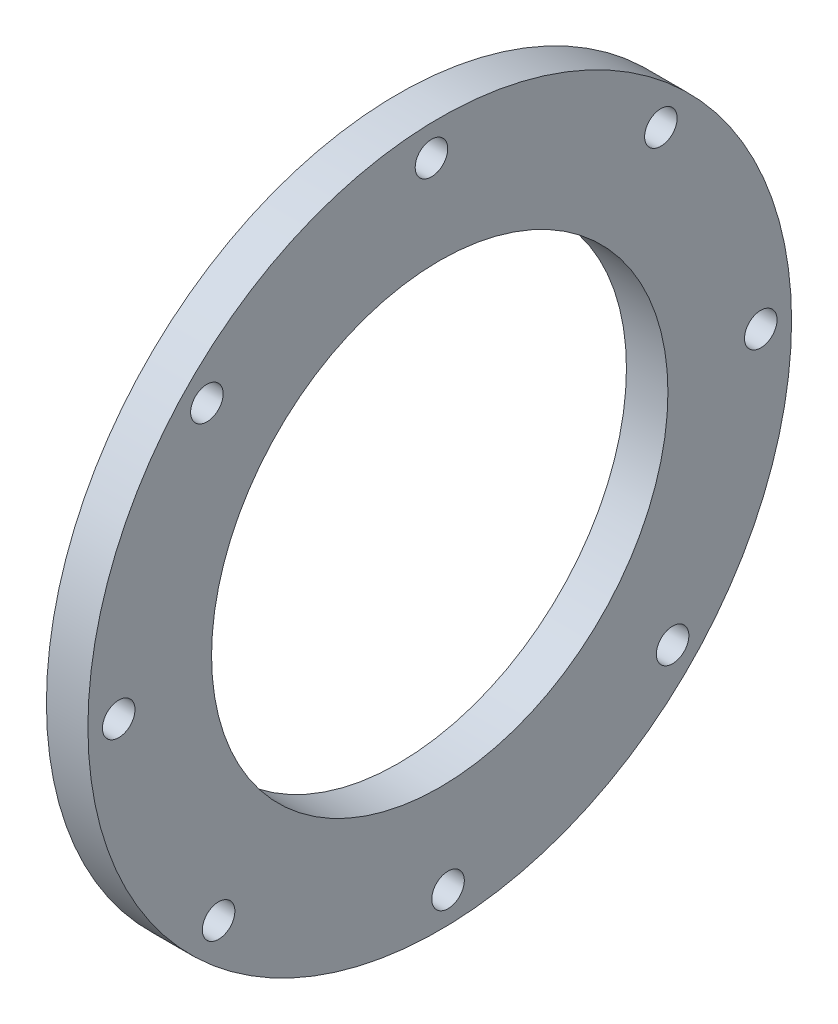
ISO-10303-21;
HEADER;
FILE_DESCRIPTION(('STEP AP214'),'2;1');
FILE_NAME('part.step','',(''),(''),'','','');
FILE_SCHEMA(('AUTOMOTIVE_DESIGN { 1 0 10303 214 1 1 1 1 }'));
ENDSEC;
DATA;
#1=APPLICATION_CONTEXT('core data for automotive mechanical design processes');
#2=APPLICATION_PROTOCOL_DEFINITION('international standard','automotive_design',2000,#1);
#3=PRODUCT_CONTEXT('',#1,'mechanical');
#4=PRODUCT('Part','Part','',(#3));
#5=PRODUCT_RELATED_PRODUCT_CATEGORY('part','',(#4));
#6=PRODUCT_DEFINITION_FORMATION('','',#4);
#7=PRODUCT_DEFINITION_CONTEXT('part definition',#1,'design');
#8=PRODUCT_DEFINITION('design','',#6,#7);
#9=PRODUCT_DEFINITION_SHAPE('','',#8);
#10=(LENGTH_UNIT() NAMED_UNIT(*) SI_UNIT(.MILLI.,.METRE.));
#11=(NAMED_UNIT(*) PLANE_ANGLE_UNIT() SI_UNIT($,.RADIAN.));
#12=(NAMED_UNIT(*) SI_UNIT($,.STERADIAN.) SOLID_ANGLE_UNIT());
#13=UNCERTAINTY_MEASURE_WITH_UNIT(LENGTH_MEASURE(1.E-05),#10,'distance_accuracy_value','');
#14=(GEOMETRIC_REPRESENTATION_CONTEXT(3) GLOBAL_UNCERTAINTY_ASSIGNED_CONTEXT((#13)) GLOBAL_UNIT_ASSIGNED_CONTEXT((#10,
#11,#12)) REPRESENTATION_CONTEXT('',''));
#15=CARTESIAN_POINT('',(0.,0.,0.));
#16=DIRECTION('',(0.,0.,1.));
#17=DIRECTION('',(1.,0.,0.));
#18=AXIS2_PLACEMENT_3D('',#15,#16,#17);
#19=CARTESIAN_POINT('',(-95.25,0.,0.));
#20=DIRECTION('',(-1.,0.,0.));
#21=DIRECTION('',(0.,0.,1.));
#22=AXIS2_PLACEMENT_3D('',#19,#20,#21);
#23=PLANE('',#22);
#24=CARTESIAN_POINT('',(-95.25,-33.8451131491048,-35.6389185711925));
#25=DIRECTION('',(-1.,0.,0.));
#26=DIRECTION('',(0.,0.,1.));
#27=AXIS2_PLACEMENT_3D('',#24,#25,#26);
#28=CIRCLE('',#27,2.4892);
#29=CARTESIAN_POINT('',(-95.25,-33.8451131491048,-33.1497185711925));
#30=VERTEX_POINT('',#29);
#31=EDGE_CURVE('E84',#30,#30,#28,.T.);
#32=ORIENTED_EDGE('',*,*,#31,.F.);
#33=EDGE_LOOP('',(#32));
#34=FACE_BOUND('',#33,.T.);
#35=CARTESIAN_POINT('',(-95.25,-35.6389185711926,33.8451131491078));
#36=DIRECTION('',(-1.,0.,0.));
#37=DIRECTION('',(0.,0.,1.));
#38=AXIS2_PLACEMENT_3D('',#35,#36,#37);
#39=CIRCLE('',#38,2.4892);
#40=CARTESIAN_POINT('',(-95.25,-35.6389185711926,36.3343131491078));
#41=VERTEX_POINT('',#40);
#42=EDGE_CURVE('E72',#41,#41,#39,.T.);
#43=ORIENTED_EDGE('',*,*,#42,.F.);
#44=EDGE_LOOP('',(#43));
#45=FACE_BOUND('',#44,.T.);
#46=CARTESIAN_POINT('',(-95.25,33.8451131491077,35.6389185711955));
#47=DIRECTION('',(-1.,0.,0.));
#48=DIRECTION('',(0.,0.,1.));
#49=AXIS2_PLACEMENT_3D('',#46,#47,#48);
#50=CIRCLE('',#49,2.4892);
#51=CARTESIAN_POINT('',(-95.25,33.8451131491077,38.1281185711955));
#52=VERTEX_POINT('',#51);
#53=EDGE_CURVE('E60',#52,#52,#50,.T.);
#54=ORIENTED_EDGE('',*,*,#53,.F.);
#55=EDGE_LOOP('',(#54));
#56=FACE_BOUND('',#55,.T.);
#57=CARTESIAN_POINT('',(-95.25,35.6389185711954,-33.8451131491047));
#58=DIRECTION('',(-1.,0.,0.));
#59=DIRECTION('',(0.,0.,1.));
#60=AXIS2_PLACEMENT_3D('',#57,#58,#59);
#61=CIRCLE('',#60,2.4892);
#62=CARTESIAN_POINT('',(-95.25,35.6389185711954,-31.3559131491047));
#63=VERTEX_POINT('',#62);
#64=EDGE_CURVE('E48',#63,#63,#61,.T.);
#65=ORIENTED_EDGE('',*,*,#64,.F.);
#66=EDGE_LOOP('',(#65));
#67=FACE_BOUND('',#66,.T.);
#68=CARTESIAN_POINT('',(-95.25,0.,0.));
#69=DIRECTION('',(-1.,0.,0.));
#70=DIRECTION('',(0.,0.,1.));
#71=AXIS2_PLACEMENT_3D('',#68,#69,#70);
#72=CIRCLE('',#71,53.848);
#73=CARTESIAN_POINT('',(-95.25,0.,53.848));
#74=VERTEX_POINT('',#73);
#75=EDGE_CURVE('E10',#74,#74,#72,.T.);
#76=ORIENTED_EDGE('',*,*,#75,.T.);
#77=EDGE_LOOP('',(#76));
#78=FACE_BOUND('',#77,.T.);
#79=CARTESIAN_POINT('',(-95.25,0.,0.));
#80=DIRECTION('',(-1.,0.,0.));
#81=DIRECTION('',(0.,0.,1.));
#82=AXIS2_PLACEMENT_3D('',#79,#80,#81);
#83=CIRCLE('',#82,34.925);
#84=CARTESIAN_POINT('',(-95.25,0.,34.925));
#85=VERTEX_POINT('',#84);
#86=EDGE_CURVE('E43',#85,#85,#83,.T.);
#87=ORIENTED_EDGE('',*,*,#86,.F.);
#88=EDGE_LOOP('',(#87));
#89=FACE_BOUND('',#88,.T.);
#90=CARTESIAN_POINT('',(-95.25,49.1326300136069,1.26841197808897));
#91=DIRECTION('',(-1.,0.,0.));
#92=DIRECTION('',(0.,0.,1.));
#93=AXIS2_PLACEMENT_3D('',#90,#91,#92);
#94=CIRCLE('',#93,2.4892);
#95=CARTESIAN_POINT('',(-95.25,49.1326300136069,3.75761197808897));
#96=VERTEX_POINT('',#95);
#97=EDGE_CURVE('E54',#96,#96,#94,.T.);
#98=ORIENTED_EDGE('',*,*,#97,.F.);
#99=EDGE_LOOP('',(#98));
#100=FACE_BOUND('',#99,.T.);
#101=CARTESIAN_POINT('',(-95.25,-1.26841197808603,49.132630013607));
#102=DIRECTION('',(-1.,0.,0.));
#103=DIRECTION('',(0.,0.,1.));
#104=AXIS2_PLACEMENT_3D('',#101,#102,#103);
#105=CIRCLE('',#104,2.4892);
#106=CARTESIAN_POINT('',(-95.25,-1.26841197808603,51.621830013607));
#107=VERTEX_POINT('',#106);
#108=EDGE_CURVE('E66',#107,#107,#105,.T.);
#109=ORIENTED_EDGE('',*,*,#108,.F.);
#110=EDGE_LOOP('',(#109));
#111=FACE_BOUND('',#110,.T.);
#112=CARTESIAN_POINT('',(-95.25,-49.132630013604,-1.26841197808594));
#113=DIRECTION('',(-1.,0.,0.));
#114=DIRECTION('',(0.,0.,1.));
#115=AXIS2_PLACEMENT_3D('',#112,#113,#114);
#116=CIRCLE('',#115,2.4892);
#117=CARTESIAN_POINT('',(-95.25,-49.132630013604,1.22078802191406));
#118=VERTEX_POINT('',#117);
#119=EDGE_CURVE('E78',#118,#118,#116,.T.);
#120=ORIENTED_EDGE('',*,*,#119,.F.);
#121=EDGE_LOOP('',(#120));
#122=FACE_BOUND('',#121,.T.);
#123=CARTESIAN_POINT('',(-95.25,1.26841197808887,-49.132630013604));
#124=DIRECTION('',(-1.,0.,0.));
#125=DIRECTION('',(0.,0.,1.));
#126=AXIS2_PLACEMENT_3D('',#123,#124,#125);
#127=CIRCLE('',#126,2.4892);
#128=CARTESIAN_POINT('',(-95.25,1.26841197808887,-46.643430013604));
#129=VERTEX_POINT('',#128);
#130=EDGE_CURVE('E90',#129,#129,#127,.T.);
#131=ORIENTED_EDGE('',*,*,#130,.F.);
#132=EDGE_LOOP('',(#131));
#133=FACE_BOUND('',#132,.T.);
#134=ADVANCED_FACE('F32',(#34,#45,#56,#67,#78,#89,#100,#111,#122,#133),#23,.T.);
#135=CARTESIAN_POINT('',(-88.9,0.,0.));
#136=DIRECTION('',(-1.,0.,0.));
#137=DIRECTION('',(0.,0.,1.));
#138=AXIS2_PLACEMENT_3D('',#135,#136,#137);
#139=PLANE('',#138);
#140=CARTESIAN_POINT('',(-88.9,0.,0.));
#141=DIRECTION('',(-1.,0.,0.));
#142=DIRECTION('',(0.,0.,1.));
#143=AXIS2_PLACEMENT_3D('',#140,#141,#142);
#144=CIRCLE('',#143,53.848);
#145=CARTESIAN_POINT('',(-88.9,0.,53.848));
#146=VERTEX_POINT('',#145);
#147=EDGE_CURVE('E36',#146,#146,#144,.T.);
#148=ORIENTED_EDGE('',*,*,#147,.F.);
#149=EDGE_LOOP('',(#148));
#150=FACE_BOUND('',#149,.T.);
#151=CARTESIAN_POINT('',(-88.9,0.,0.));
#152=DIRECTION('',(-1.,0.,0.));
#153=DIRECTION('',(0.,0.,1.));
#154=AXIS2_PLACEMENT_3D('',#151,#152,#153);
#155=CIRCLE('',#154,34.925);
#156=CARTESIAN_POINT('',(-88.9,0.,34.925));
#157=VERTEX_POINT('',#156);
#158=EDGE_CURVE('E45',#157,#157,#155,.T.);
#159=ORIENTED_EDGE('',*,*,#158,.T.);
#160=EDGE_LOOP('',(#159));
#161=FACE_BOUND('',#160,.T.);
#162=CARTESIAN_POINT('',(-88.9,35.6389185711954,-33.8451131491047));
#163=DIRECTION('',(-1.,0.,0.));
#164=DIRECTION('',(0.,0.,1.));
#165=AXIS2_PLACEMENT_3D('',#162,#163,#164);
#166=CIRCLE('',#165,2.4892);
#167=CARTESIAN_POINT('',(-88.9,35.6389185711954,-31.3559131491047));
#168=VERTEX_POINT('',#167);
#169=EDGE_CURVE('E51',#168,#168,#166,.T.);
#170=ORIENTED_EDGE('',*,*,#169,.T.);
#171=EDGE_LOOP('',(#170));
#172=FACE_BOUND('',#171,.T.);
#173=CARTESIAN_POINT('',(-88.9,49.1326300136069,1.26841197808897));
#174=DIRECTION('',(-1.,0.,0.));
#175=DIRECTION('',(0.,0.,1.));
#176=AXIS2_PLACEMENT_3D('',#173,#174,#175);
#177=CIRCLE('',#176,2.4892);
#178=CARTESIAN_POINT('',(-88.9,49.1326300136069,3.75761197808897));
#179=VERTEX_POINT('',#178);
#180=EDGE_CURVE('E57',#179,#179,#177,.T.);
#181=ORIENTED_EDGE('',*,*,#180,.T.);
#182=EDGE_LOOP('',(#181));
#183=FACE_BOUND('',#182,.T.);
#184=CARTESIAN_POINT('',(-88.9,33.8451131491077,35.6389185711955));
#185=DIRECTION('',(-1.,0.,0.));
#186=DIRECTION('',(0.,0.,1.));
#187=AXIS2_PLACEMENT_3D('',#184,#185,#186);
#188=CIRCLE('',#187,2.4892);
#189=CARTESIAN_POINT('',(-88.9,33.8451131491077,38.1281185711955));
#190=VERTEX_POINT('',#189);
#191=EDGE_CURVE('E63',#190,#190,#188,.T.);
#192=ORIENTED_EDGE('',*,*,#191,.T.);
#193=EDGE_LOOP('',(#192));
#194=FACE_BOUND('',#193,.T.);
#195=CARTESIAN_POINT('',(-88.9,-1.26841197808603,49.132630013607));
#196=DIRECTION('',(-1.,0.,0.));
#197=DIRECTION('',(0.,0.,1.));
#198=AXIS2_PLACEMENT_3D('',#195,#196,#197);
#199=CIRCLE('',#198,2.4892);
#200=CARTESIAN_POINT('',(-88.9,-1.26841197808603,51.621830013607));
#201=VERTEX_POINT('',#200);
#202=EDGE_CURVE('E69',#201,#201,#199,.T.);
#203=ORIENTED_EDGE('',*,*,#202,.T.);
#204=EDGE_LOOP('',(#203));
#205=FACE_BOUND('',#204,.T.);
#206=CARTESIAN_POINT('',(-88.9,-35.6389185711926,33.8451131491078));
#207=DIRECTION('',(-1.,0.,0.));
#208=DIRECTION('',(0.,0.,1.));
#209=AXIS2_PLACEMENT_3D('',#206,#207,#208);
#210=CIRCLE('',#209,2.4892);
#211=CARTESIAN_POINT('',(-88.9,-35.6389185711926,36.3343131491078));
#212=VERTEX_POINT('',#211);
#213=EDGE_CURVE('E75',#212,#212,#210,.T.);
#214=ORIENTED_EDGE('',*,*,#213,.T.);
#215=EDGE_LOOP('',(#214));
#216=FACE_BOUND('',#215,.T.);
#217=CARTESIAN_POINT('',(-88.9,-49.132630013604,-1.26841197808594));
#218=DIRECTION('',(-1.,0.,0.));
#219=DIRECTION('',(0.,0.,1.));
#220=AXIS2_PLACEMENT_3D('',#217,#218,#219);
#221=CIRCLE('',#220,2.4892);
#222=CARTESIAN_POINT('',(-88.9,-49.132630013604,1.22078802191406));
#223=VERTEX_POINT('',#222);
#224=EDGE_CURVE('E81',#223,#223,#221,.T.);
#225=ORIENTED_EDGE('',*,*,#224,.T.);
#226=EDGE_LOOP('',(#225));
#227=FACE_BOUND('',#226,.T.);
#228=CARTESIAN_POINT('',(-88.9,-33.8451131491048,-35.6389185711925));
#229=DIRECTION('',(-1.,0.,0.));
#230=DIRECTION('',(0.,0.,1.));
#231=AXIS2_PLACEMENT_3D('',#228,#229,#230);
#232=CIRCLE('',#231,2.4892);
#233=CARTESIAN_POINT('',(-88.9,-33.8451131491048,-33.1497185711925));
#234=VERTEX_POINT('',#233);
#235=EDGE_CURVE('E87',#234,#234,#232,.T.);
#236=ORIENTED_EDGE('',*,*,#235,.T.);
#237=EDGE_LOOP('',(#236));
#238=FACE_BOUND('',#237,.T.);
#239=CARTESIAN_POINT('',(-88.9,1.26841197808887,-49.132630013604));
#240=DIRECTION('',(-1.,0.,0.));
#241=DIRECTION('',(0.,0.,1.));
#242=AXIS2_PLACEMENT_3D('',#239,#240,#241);
#243=CIRCLE('',#242,2.4892);
#244=CARTESIAN_POINT('',(-88.9,1.26841197808887,-46.643430013604));
#245=VERTEX_POINT('',#244);
#246=EDGE_CURVE('E93',#245,#245,#243,.T.);
#247=ORIENTED_EDGE('',*,*,#246,.T.);
#248=EDGE_LOOP('',(#247));
#249=FACE_BOUND('',#248,.T.);
#250=ADVANCED_FACE('F103',(#150,#161,#172,#183,#194,#205,#216,#227,#238,#249),#139,.F.);
#251=CARTESIAN_POINT('',(-95.25,0.,0.));
#252=DIRECTION('',(1.,0.,0.));
#253=DIRECTION('',(0.,0.,-1.));
#254=AXIS2_PLACEMENT_3D('',#251,#252,#253);
#255=CYLINDRICAL_SURFACE('',#254,53.848);
#256=ORIENTED_EDGE('',*,*,#75,.F.);
#257=EDGE_LOOP('',(#256));
#258=FACE_BOUND('',#257,.T.);
#259=ORIENTED_EDGE('',*,*,#147,.T.);
#260=EDGE_LOOP('',(#259));
#261=FACE_BOUND('',#260,.T.);
#262=ADVANCED_FACE('F34',(#258,#261),#255,.T.);
#263=CARTESIAN_POINT('',(-95.25,0.,0.));
#264=DIRECTION('',(1.,0.,0.));
#265=DIRECTION('',(0.,0.,-1.));
#266=AXIS2_PLACEMENT_3D('',#263,#264,#265);
#267=CYLINDRICAL_SURFACE('',#266,34.925);
#268=ORIENTED_EDGE('',*,*,#86,.T.);
#269=EDGE_LOOP('',(#268));
#270=FACE_BOUND('',#269,.T.);
#271=ORIENTED_EDGE('',*,*,#158,.F.);
#272=EDGE_LOOP('',(#271));
#273=FACE_BOUND('',#272,.T.);
#274=ADVANCED_FACE('F113',(#270,#273),#267,.F.);
#275=CARTESIAN_POINT('',(-95.25,35.6389185711954,-33.8451131491047));
#276=DIRECTION('',(1.,0.,0.));
#277=DIRECTION('',(0.,0.,-1.));
#278=AXIS2_PLACEMENT_3D('',#275,#276,#277);
#279=CYLINDRICAL_SURFACE('',#278,2.4892);
#280=ORIENTED_EDGE('',*,*,#64,.T.);
#281=EDGE_LOOP('',(#280));
#282=FACE_BOUND('',#281,.T.);
#283=ORIENTED_EDGE('',*,*,#169,.F.);
#284=EDGE_LOOP('',(#283));
#285=FACE_BOUND('',#284,.T.);
#286=ADVANCED_FACE('F116',(#282,#285),#279,.F.);
#287=CARTESIAN_POINT('',(-95.25,49.1326300136069,1.26841197808897));
#288=DIRECTION('',(1.,0.,0.));
#289=DIRECTION('',(0.,0.,-1.));
#290=AXIS2_PLACEMENT_3D('',#287,#288,#289);
#291=CYLINDRICAL_SURFACE('',#290,2.4892);
#292=ORIENTED_EDGE('',*,*,#97,.T.);
#293=EDGE_LOOP('',(#292));
#294=FACE_BOUND('',#293,.T.);
#295=ORIENTED_EDGE('',*,*,#180,.F.);
#296=EDGE_LOOP('',(#295));
#297=FACE_BOUND('',#296,.T.);
#298=ADVANCED_FACE('F120',(#294,#297),#291,.F.);
#299=CARTESIAN_POINT('',(-95.25,33.8451131491077,35.6389185711955));
#300=DIRECTION('',(1.,0.,0.));
#301=DIRECTION('',(0.,0.,-1.));
#302=AXIS2_PLACEMENT_3D('',#299,#300,#301);
#303=CYLINDRICAL_SURFACE('',#302,2.4892);
#304=ORIENTED_EDGE('',*,*,#53,.T.);
#305=EDGE_LOOP('',(#304));
#306=FACE_BOUND('',#305,.T.);
#307=ORIENTED_EDGE('',*,*,#191,.F.);
#308=EDGE_LOOP('',(#307));
#309=FACE_BOUND('',#308,.T.);
#310=ADVANCED_FACE('F124',(#306,#309),#303,.F.);
#311=CARTESIAN_POINT('',(-95.25,-1.26841197808603,49.132630013607));
#312=DIRECTION('',(1.,0.,0.));
#313=DIRECTION('',(0.,0.,-1.));
#314=AXIS2_PLACEMENT_3D('',#311,#312,#313);
#315=CYLINDRICAL_SURFACE('',#314,2.4892);
#316=ORIENTED_EDGE('',*,*,#108,.T.);
#317=EDGE_LOOP('',(#316));
#318=FACE_BOUND('',#317,.T.);
#319=ORIENTED_EDGE('',*,*,#202,.F.);
#320=EDGE_LOOP('',(#319));
#321=FACE_BOUND('',#320,.T.);
#322=ADVANCED_FACE('F128',(#318,#321),#315,.F.);
#323=CARTESIAN_POINT('',(-95.25,-35.6389185711926,33.8451131491078));
#324=DIRECTION('',(1.,0.,0.));
#325=DIRECTION('',(0.,0.,-1.));
#326=AXIS2_PLACEMENT_3D('',#323,#324,#325);
#327=CYLINDRICAL_SURFACE('',#326,2.4892);
#328=ORIENTED_EDGE('',*,*,#42,.T.);
#329=EDGE_LOOP('',(#328));
#330=FACE_BOUND('',#329,.T.);
#331=ORIENTED_EDGE('',*,*,#213,.F.);
#332=EDGE_LOOP('',(#331));
#333=FACE_BOUND('',#332,.T.);
#334=ADVANCED_FACE('F132',(#330,#333),#327,.F.);
#335=CARTESIAN_POINT('',(-95.25,-49.132630013604,-1.26841197808594));
#336=DIRECTION('',(1.,0.,0.));
#337=DIRECTION('',(0.,0.,-1.));
#338=AXIS2_PLACEMENT_3D('',#335,#336,#337);
#339=CYLINDRICAL_SURFACE('',#338,2.4892);
#340=ORIENTED_EDGE('',*,*,#119,.T.);
#341=EDGE_LOOP('',(#340));
#342=FACE_BOUND('',#341,.T.);
#343=ORIENTED_EDGE('',*,*,#224,.F.);
#344=EDGE_LOOP('',(#343));
#345=FACE_BOUND('',#344,.T.);
#346=ADVANCED_FACE('F136',(#342,#345),#339,.F.);
#347=CARTESIAN_POINT('',(-95.25,-33.8451131491048,-35.6389185711925));
#348=DIRECTION('',(1.,0.,0.));
#349=DIRECTION('',(0.,0.,-1.));
#350=AXIS2_PLACEMENT_3D('',#347,#348,#349);
#351=CYLINDRICAL_SURFACE('',#350,2.4892);
#352=ORIENTED_EDGE('',*,*,#31,.T.);
#353=EDGE_LOOP('',(#352));
#354=FACE_BOUND('',#353,.T.);
#355=ORIENTED_EDGE('',*,*,#235,.F.);
#356=EDGE_LOOP('',(#355));
#357=FACE_BOUND('',#356,.T.);
#358=ADVANCED_FACE('F140',(#354,#357),#351,.F.);
#359=CARTESIAN_POINT('',(-95.25,1.26841197808887,-49.132630013604));
#360=DIRECTION('',(1.,0.,0.));
#361=DIRECTION('',(0.,0.,-1.));
#362=AXIS2_PLACEMENT_3D('',#359,#360,#361);
#363=CYLINDRICAL_SURFACE('',#362,2.4892);
#364=ORIENTED_EDGE('',*,*,#130,.T.);
#365=EDGE_LOOP('',(#364));
#366=FACE_BOUND('',#365,.T.);
#367=ORIENTED_EDGE('',*,*,#246,.F.);
#368=EDGE_LOOP('',(#367));
#369=FACE_BOUND('',#368,.T.);
#370=ADVANCED_FACE('F99',(#366,#369),#363,.F.);
#371=CLOSED_SHELL('',(#134,#250,#262,#274,#286,#298,#310,#322,#334,#346,#358,#370));
#372=MANIFOLD_SOLID_BREP('B2',#371);
#373=ADVANCED_BREP_SHAPE_REPRESENTATION('',(#18,#372),#14);
#374=SHAPE_DEFINITION_REPRESENTATION(#9,#373);
ENDSEC;
END-ISO-10303-21;
